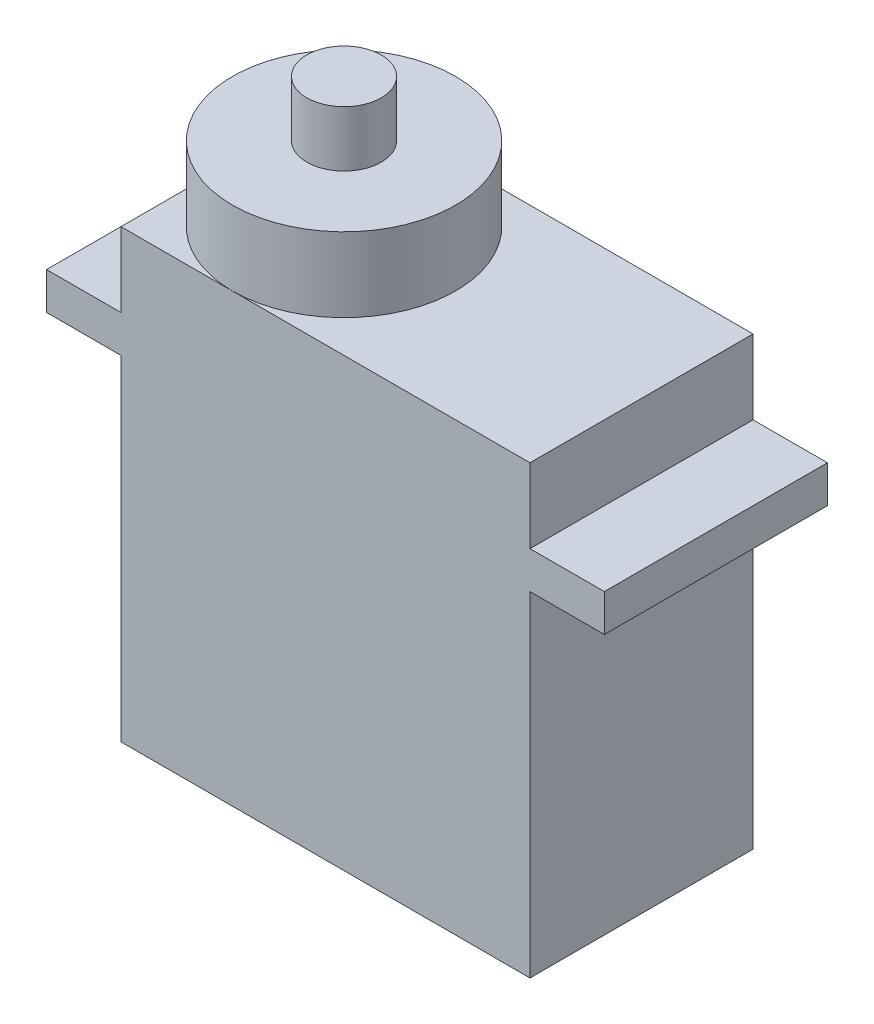
ISO-10303-21;
HEADER;
FILE_DESCRIPTION(('STEP AP214'),'2;1');
FILE_NAME('part.step','',(''),(''),'','','');
FILE_SCHEMA(('AUTOMOTIVE_DESIGN { 1 0 10303 214 1 1 1 1 }'));
ENDSEC;
DATA;
#1=APPLICATION_CONTEXT('core data for automotive mechanical design processes');
#2=APPLICATION_PROTOCOL_DEFINITION('international standard','automotive_design',2000,#1);
#3=PRODUCT_CONTEXT('',#1,'mechanical');
#4=PRODUCT('Part','Part','',(#3));
#5=PRODUCT_RELATED_PRODUCT_CATEGORY('part','',(#4));
#6=PRODUCT_DEFINITION_FORMATION('','',#4);
#7=PRODUCT_DEFINITION_CONTEXT('part definition',#1,'design');
#8=PRODUCT_DEFINITION('design','',#6,#7);
#9=PRODUCT_DEFINITION_SHAPE('','',#8);
#10=(LENGTH_UNIT() NAMED_UNIT(*) SI_UNIT(.MILLI.,.METRE.));
#11=(NAMED_UNIT(*) PLANE_ANGLE_UNIT() SI_UNIT($,.RADIAN.));
#12=(NAMED_UNIT(*) SI_UNIT($,.STERADIAN.) SOLID_ANGLE_UNIT());
#13=UNCERTAINTY_MEASURE_WITH_UNIT(LENGTH_MEASURE(1.E-05),#10,'distance_accuracy_value','');
#14=(GEOMETRIC_REPRESENTATION_CONTEXT(3) GLOBAL_UNCERTAINTY_ASSIGNED_CONTEXT((#13)) GLOBAL_UNIT_ASSIGNED_CONTEXT((#10,
#11,#12)) REPRESENTATION_CONTEXT('',''));
#15=CARTESIAN_POINT('',(0.,0.,0.));
#16=DIRECTION('',(0.,0.,1.));
#17=DIRECTION('',(1.,0.,0.));
#18=AXIS2_PLACEMENT_3D('',#15,#16,#17);
#19=CARTESIAN_POINT('',(-11.,12.,12.));
#20=DIRECTION('',(0.,-1.,0.));
#21=DIRECTION('',(0.,0.,-1.));
#22=AXIS2_PLACEMENT_3D('',#19,#20,#21);
#23=PLANE('',#22);
#24=CARTESIAN_POINT('',(-5.,12.,6.));
#25=DIRECTION('',(0.,1.,0.));
#26=DIRECTION('',(0.,0.,1.));
#27=AXIS2_PLACEMENT_3D('',#24,#25,#26);
#28=CIRCLE('',#27,6.);
#29=CARTESIAN_POINT('',(-5.,12.,12.));
#30=VERTEX_POINT('',#29);
#31=CARTESIAN_POINT('',(-5.,12.,0.));
#32=VERTEX_POINT('',#31);
#33=EDGE_CURVE('E155',#30,#32,#28,.T.);
#34=ORIENTED_EDGE('',*,*,#33,.F.);
#35=DIRECTION('',(-1.,0.,0.));
#36=VECTOR('',#35,1.);
#37=CARTESIAN_POINT('',(-11.,12.,12.));
#38=LINE('',#37,#36);
#39=CARTESIAN_POINT('',(11.,12.,12.));
#40=VERTEX_POINT('',#39);
#41=EDGE_CURVE('E134',#40,#30,#38,.T.);
#42=ORIENTED_EDGE('',*,*,#41,.F.);
#43=DIRECTION('',(0.,0.,-1.));
#44=VECTOR('',#43,1.);
#45=CARTESIAN_POINT('',(11.,12.,12.));
#46=LINE('',#45,#44);
#47=CARTESIAN_POINT('',(11.,12.,0.));
#48=VERTEX_POINT('',#47);
#49=EDGE_CURVE('E37',#40,#48,#46,.T.);
#50=ORIENTED_EDGE('',*,*,#49,.T.);
#51=DIRECTION('',(-1.,0.,0.));
#52=VECTOR('',#51,1.);
#53=CARTESIAN_POINT('',(-11.,12.,0.));
#54=LINE('',#53,#52);
#55=EDGE_CURVE('E157',#48,#32,#54,.T.);
#56=ORIENTED_EDGE('',*,*,#55,.T.);
#57=EDGE_LOOP('',(#34,#42,#50,#56));
#58=FACE_BOUND('',#57,.T.);
#59=ADVANCED_FACE('F33',(#58),#23,.F.);
#60=CARTESIAN_POINT('',(-11.,12.,6.));
#61=VERTEX_POINT('',#60);
#62=EDGE_CURVE('E42',#32,#61,#28,.T.);
#63=ORIENTED_EDGE('',*,*,#62,.F.);
#64=CARTESIAN_POINT('',(-11.,12.,0.));
#65=VERTEX_POINT('',#64);
#66=EDGE_CURVE('E224',#32,#65,#54,.T.);
#67=ORIENTED_EDGE('',*,*,#66,.T.);
#68=DIRECTION('',(0.,0.,-1.));
#69=VECTOR('',#68,1.);
#70=CARTESIAN_POINT('',(-11.,12.,12.));
#71=LINE('',#70,#69);
#72=EDGE_CURVE('E236',#61,#65,#71,.T.);
#73=ORIENTED_EDGE('',*,*,#72,.F.);
#74=EDGE_LOOP('',(#63,#67,#73));
#75=FACE_BOUND('',#74,.T.);
#76=ADVANCED_FACE('F240',(#75),#23,.F.);
#77=CARTESIAN_POINT('',(11.,-12.,12.));
#78=DIRECTION('',(-1.,0.,0.));
#79=DIRECTION('',(0.,0.,1.));
#80=AXIS2_PLACEMENT_3D('',#77,#78,#79);
#81=PLANE('',#80);
#82=DIRECTION('',(0.,1.,0.));
#83=VECTOR('',#82,1.);
#84=CARTESIAN_POINT('',(11.,-12.,12.));
#85=LINE('',#84,#83);
#86=CARTESIAN_POINT('',(11.,8.,12.));
#87=VERTEX_POINT('',#86);
#88=EDGE_CURVE('E141',#87,#40,#85,.T.);
#89=ORIENTED_EDGE('',*,*,#88,.F.);
#90=DIRECTION('',(0.,0.,-1.));
#91=VECTOR('',#90,1.);
#92=CARTESIAN_POINT('',(11.,8.,12.));
#93=LINE('',#92,#91);
#94=CARTESIAN_POINT('',(11.,8.,0.));
#95=VERTEX_POINT('',#94);
#96=EDGE_CURVE('E211',#87,#95,#93,.T.);
#97=ORIENTED_EDGE('',*,*,#96,.T.);
#98=DIRECTION('',(0.,1.,0.));
#99=VECTOR('',#98,1.);
#100=CARTESIAN_POINT('',(11.,-12.,0.));
#101=LINE('',#100,#99);
#102=EDGE_CURVE('E214',#95,#48,#101,.T.);
#103=ORIENTED_EDGE('',*,*,#102,.T.);
#104=ORIENTED_EDGE('',*,*,#49,.F.);
#105=EDGE_LOOP('',(#89,#97,#103,#104));
#106=FACE_BOUND('',#105,.T.);
#107=ADVANCED_FACE('F280',(#106),#81,.F.);
#108=CARTESIAN_POINT('',(-11.,-12.,12.));
#109=DIRECTION('',(1.,0.,0.));
#110=DIRECTION('',(0.,0.,-1.));
#111=AXIS2_PLACEMENT_3D('',#108,#109,#110);
#112=PLANE('',#111);
#113=DIRECTION('',(0.,-1.,0.));
#114=VECTOR('',#113,1.);
#115=CARTESIAN_POINT('',(-11.,-12.,0.));
#116=LINE('',#115,#114);
#117=CARTESIAN_POINT('',(-11.,8.,0.));
#118=VERTEX_POINT('',#117);
#119=EDGE_CURVE('E227',#65,#118,#116,.T.);
#120=ORIENTED_EDGE('',*,*,#119,.T.);
#121=DIRECTION('',(0.,0.,1.));
#122=VECTOR('',#121,1.);
#123=CARTESIAN_POINT('',(-11.,8.,12.));
#124=LINE('',#123,#122);
#125=CARTESIAN_POINT('',(-11.,8.,12.));
#126=VERTEX_POINT('',#125);
#127=EDGE_CURVE('E208',#118,#126,#124,.T.);
#128=ORIENTED_EDGE('',*,*,#127,.T.);
#129=DIRECTION('',(0.,-1.,0.));
#130=VECTOR('',#129,1.);
#131=CARTESIAN_POINT('',(-11.,-12.,12.));
#132=LINE('',#131,#130);
#133=CARTESIAN_POINT('',(-11.,12.,12.));
#134=VERTEX_POINT('',#133);
#135=EDGE_CURVE('E216',#134,#126,#132,.T.);
#136=ORIENTED_EDGE('',*,*,#135,.F.);
#137=EDGE_CURVE('E150',#134,#61,#71,.T.);
#138=ORIENTED_EDGE('',*,*,#137,.T.);
#139=ORIENTED_EDGE('',*,*,#72,.T.);
#140=EDGE_LOOP('',(#120,#128,#136,#138,#139));
#141=FACE_BOUND('',#140,.T.);
#142=ADVANCED_FACE('F238',(#141),#112,.F.);
#143=CARTESIAN_POINT('',(11.,-12.,0.));
#144=VERTEX_POINT('',#143);
#145=CARTESIAN_POINT('',(11.,6.,0.));
#146=VERTEX_POINT('',#145);
#147=EDGE_CURVE('E221',#144,#146,#101,.T.);
#148=ORIENTED_EDGE('',*,*,#147,.T.);
#149=DIRECTION('',(0.,0.,1.));
#150=VECTOR('',#149,1.);
#151=CARTESIAN_POINT('',(11.,6.,12.));
#152=LINE('',#151,#150);
#153=CARTESIAN_POINT('',(11.,6.,12.));
#154=VERTEX_POINT('',#153);
#155=EDGE_CURVE('E205',#146,#154,#152,.T.);
#156=ORIENTED_EDGE('',*,*,#155,.T.);
#157=CARTESIAN_POINT('',(11.,-12.,12.));
#158=VERTEX_POINT('',#157);
#159=EDGE_CURVE('E152',#158,#154,#85,.T.);
#160=ORIENTED_EDGE('',*,*,#159,.F.);
#161=DIRECTION('',(0.,0.,-1.));
#162=VECTOR('',#161,1.);
#163=CARTESIAN_POINT('',(11.,-12.,12.));
#164=LINE('',#163,#162);
#165=EDGE_CURVE('E220',#158,#144,#164,.T.);
#166=ORIENTED_EDGE('',*,*,#165,.T.);
#167=EDGE_LOOP('',(#148,#156,#160,#166));
#168=FACE_BOUND('',#167,.T.);
#169=ADVANCED_FACE('F35',(#168),#81,.F.);
#170=EDGE_CURVE('E50',#61,#30,#28,.T.);
#171=ORIENTED_EDGE('',*,*,#170,.F.);
#172=ORIENTED_EDGE('',*,*,#137,.F.);
#173=EDGE_CURVE('E138',#30,#134,#38,.T.);
#174=ORIENTED_EDGE('',*,*,#173,.F.);
#175=EDGE_LOOP('',(#171,#172,#174));
#176=FACE_BOUND('',#175,.T.);
#177=ADVANCED_FACE('F148',(#176),#23,.F.);
#178=CARTESIAN_POINT('',(-11.,6.,12.));
#179=VERTEX_POINT('',#178);
#180=CARTESIAN_POINT('',(-11.,-12.,12.));
#181=VERTEX_POINT('',#180);
#182=EDGE_CURVE('E146',#179,#181,#132,.T.);
#183=ORIENTED_EDGE('',*,*,#182,.F.);
#184=DIRECTION('',(0.,0.,-1.));
#185=VECTOR('',#184,1.);
#186=CARTESIAN_POINT('',(-11.,6.,12.));
#187=LINE('',#186,#185);
#188=CARTESIAN_POINT('',(-11.,6.,0.));
#189=VERTEX_POINT('',#188);
#190=EDGE_CURVE('E192',#179,#189,#187,.T.);
#191=ORIENTED_EDGE('',*,*,#190,.T.);
#192=CARTESIAN_POINT('',(-11.,-12.,0.));
#193=VERTEX_POINT('',#192);
#194=EDGE_CURVE('E226',#189,#193,#116,.T.);
#195=ORIENTED_EDGE('',*,*,#194,.T.);
#196=DIRECTION('',(0.,0.,-1.));
#197=VECTOR('',#196,1.);
#198=CARTESIAN_POINT('',(-11.,-12.,12.));
#199=LINE('',#198,#197);
#200=EDGE_CURVE('E234',#181,#193,#199,.T.);
#201=ORIENTED_EDGE('',*,*,#200,.F.);
#202=EDGE_LOOP('',(#183,#191,#195,#201));
#203=FACE_BOUND('',#202,.T.);
#204=ADVANCED_FACE('F259',(#203),#112,.F.);
#205=CARTESIAN_POINT('',(-11.,-12.,12.));
#206=DIRECTION('',(0.,1.,0.));
#207=DIRECTION('',(0.,0.,1.));
#208=AXIS2_PLACEMENT_3D('',#205,#206,#207);
#209=PLANE('',#208);
#210=DIRECTION('',(1.,0.,0.));
#211=VECTOR('',#210,1.);
#212=CARTESIAN_POINT('',(-11.,-12.,0.));
#213=LINE('',#212,#211);
#214=EDGE_CURVE('E230',#193,#144,#213,.T.);
#215=ORIENTED_EDGE('',*,*,#214,.T.);
#216=ORIENTED_EDGE('',*,*,#165,.F.);
#217=DIRECTION('',(1.,0.,0.));
#218=VECTOR('',#217,1.);
#219=CARTESIAN_POINT('',(-11.,-12.,12.));
#220=LINE('',#219,#218);
#221=EDGE_CURVE('E218',#181,#158,#220,.T.);
#222=ORIENTED_EDGE('',*,*,#221,.F.);
#223=ORIENTED_EDGE('',*,*,#200,.T.);
#224=EDGE_LOOP('',(#215,#216,#222,#223));
#225=FACE_BOUND('',#224,.T.);
#226=ADVANCED_FACE('F264',(#225),#209,.F.);
#227=CARTESIAN_POINT('',(0.,0.,12.));
#228=DIRECTION('',(0.,0.,-1.));
#229=DIRECTION('',(-1.,0.,0.));
#230=AXIS2_PLACEMENT_3D('',#227,#228,#229);
#231=PLANE('',#230);
#232=ORIENTED_EDGE('',*,*,#159,.T.);
#233=DIRECTION('',(-1.,0.,0.));
#234=VECTOR('',#233,1.);
#235=CARTESIAN_POINT('',(15.,6.,12.));
#236=LINE('',#235,#234);
#237=CARTESIAN_POINT('',(15.,6.,12.));
#238=VERTEX_POINT('',#237);
#239=EDGE_CURVE('E197',#238,#154,#236,.T.);
#240=ORIENTED_EDGE('',*,*,#239,.F.);
#241=DIRECTION('',(0.,1.,0.));
#242=VECTOR('',#241,1.);
#243=CARTESIAN_POINT('',(15.,8.,12.));
#244=LINE('',#243,#242);
#245=CARTESIAN_POINT('',(15.,8.,12.));
#246=VERTEX_POINT('',#245);
#247=EDGE_CURVE('E172',#238,#246,#244,.T.);
#248=ORIENTED_EDGE('',*,*,#247,.T.);
#249=DIRECTION('',(-1.,0.,0.));
#250=VECTOR('',#249,1.);
#251=CARTESIAN_POINT('',(15.,8.,12.));
#252=LINE('',#251,#250);
#253=EDGE_CURVE('E194',#246,#87,#252,.T.);
#254=ORIENTED_EDGE('',*,*,#253,.T.);
#255=ORIENTED_EDGE('',*,*,#88,.T.);
#256=ORIENTED_EDGE('',*,*,#41,.T.);
#257=ORIENTED_EDGE('',*,*,#173,.T.);
#258=ORIENTED_EDGE('',*,*,#135,.T.);
#259=CARTESIAN_POINT('',(-15.,8.,12.));
#260=VERTEX_POINT('',#259);
#261=EDGE_CURVE('E196',#126,#260,#252,.T.);
#262=ORIENTED_EDGE('',*,*,#261,.T.);
#263=DIRECTION('',(0.,1.,0.));
#264=VECTOR('',#263,1.);
#265=CARTESIAN_POINT('',(-15.,8.,12.));
#266=LINE('',#265,#264);
#267=CARTESIAN_POINT('',(-15.,6.,12.));
#268=VERTEX_POINT('',#267);
#269=EDGE_CURVE('E185',#268,#260,#266,.T.);
#270=ORIENTED_EDGE('',*,*,#269,.F.);
#271=EDGE_CURVE('E199',#179,#268,#236,.T.);
#272=ORIENTED_EDGE('',*,*,#271,.F.);
#273=ORIENTED_EDGE('',*,*,#182,.T.);
#274=ORIENTED_EDGE('',*,*,#221,.T.);
#275=EDGE_LOOP('',(#232,#240,#248,#254,#255,#256,#257,#258,#262,#270,#272,#273,#274));
#276=FACE_BOUND('',#275,.T.);
#277=ADVANCED_FACE('F136',(#276),#231,.F.);
#278=CARTESIAN_POINT('',(0.,0.,0.));
#279=DIRECTION('',(0.,0.,-1.));
#280=DIRECTION('',(-1.,0.,0.));
#281=AXIS2_PLACEMENT_3D('',#278,#279,#280);
#282=PLANE('',#281);
#283=ORIENTED_EDGE('',*,*,#194,.F.);
#284=DIRECTION('',(-1.,0.,0.));
#285=VECTOR('',#284,1.);
#286=CARTESIAN_POINT('',(15.,6.,0.));
#287=LINE('',#286,#285);
#288=CARTESIAN_POINT('',(-15.,6.,0.));
#289=VERTEX_POINT('',#288);
#290=EDGE_CURVE('E178',#189,#289,#287,.T.);
#291=ORIENTED_EDGE('',*,*,#290,.T.);
#292=DIRECTION('',(0.,-1.,0.));
#293=VECTOR('',#292,1.);
#294=CARTESIAN_POINT('',(-15.,8.,0.));
#295=LINE('',#294,#293);
#296=CARTESIAN_POINT('',(-15.,8.,0.));
#297=VERTEX_POINT('',#296);
#298=EDGE_CURVE('E179',#297,#289,#295,.T.);
#299=ORIENTED_EDGE('',*,*,#298,.F.);
#300=DIRECTION('',(-1.,0.,0.));
#301=VECTOR('',#300,1.);
#302=CARTESIAN_POINT('',(15.,8.,0.));
#303=LINE('',#302,#301);
#304=EDGE_CURVE('E193',#118,#297,#303,.T.);
#305=ORIENTED_EDGE('',*,*,#304,.F.);
#306=ORIENTED_EDGE('',*,*,#119,.F.);
#307=ORIENTED_EDGE('',*,*,#66,.F.);
#308=ORIENTED_EDGE('',*,*,#55,.F.);
#309=ORIENTED_EDGE('',*,*,#102,.F.);
#310=CARTESIAN_POINT('',(15.,8.,0.));
#311=VERTEX_POINT('',#310);
#312=EDGE_CURVE('E190',#311,#95,#303,.T.);
#313=ORIENTED_EDGE('',*,*,#312,.F.);
#314=DIRECTION('',(0.,-1.,0.));
#315=VECTOR('',#314,1.);
#316=CARTESIAN_POINT('',(15.,8.,0.));
#317=LINE('',#316,#315);
#318=CARTESIAN_POINT('',(15.,6.,0.));
#319=VERTEX_POINT('',#318);
#320=EDGE_CURVE('E165',#311,#319,#317,.T.);
#321=ORIENTED_EDGE('',*,*,#320,.T.);
#322=EDGE_CURVE('E200',#319,#146,#287,.T.);
#323=ORIENTED_EDGE('',*,*,#322,.T.);
#324=ORIENTED_EDGE('',*,*,#147,.F.);
#325=ORIENTED_EDGE('',*,*,#214,.F.);
#326=EDGE_LOOP('',(#283,#291,#299,#305,#306,#307,#308,#309,#313,#321,#323,#324,#325));
#327=FACE_BOUND('',#326,.T.);
#328=ADVANCED_FACE('F244',(#327),#282,.T.);
#329=CARTESIAN_POINT('',(-15.,0.,0.));
#330=DIRECTION('',(-1.,0.,0.));
#331=DIRECTION('',(0.,0.,1.));
#332=AXIS2_PLACEMENT_3D('',#329,#330,#331);
#333=PLANE('',#332);
#334=ORIENTED_EDGE('',*,*,#298,.T.);
#335=DIRECTION('',(0.,0.,1.));
#336=VECTOR('',#335,1.);
#337=CARTESIAN_POINT('',(-15.,6.,0.));
#338=LINE('',#337,#336);
#339=EDGE_CURVE('E182',#289,#268,#338,.T.);
#340=ORIENTED_EDGE('',*,*,#339,.T.);
#341=ORIENTED_EDGE('',*,*,#269,.T.);
#342=DIRECTION('',(0.,0.,-1.));
#343=VECTOR('',#342,1.);
#344=CARTESIAN_POINT('',(-15.,8.,0.));
#345=LINE('',#344,#343);
#346=EDGE_CURVE('E169',#260,#297,#345,.T.);
#347=ORIENTED_EDGE('',*,*,#346,.T.);
#348=EDGE_LOOP('',(#334,#340,#341,#347));
#349=FACE_BOUND('',#348,.T.);
#350=ADVANCED_FACE('F252',(#349),#333,.T.);
#351=CARTESIAN_POINT('',(15.,6.,0.));
#352=DIRECTION('',(0.,-1.,0.));
#353=DIRECTION('',(0.,0.,-1.));
#354=AXIS2_PLACEMENT_3D('',#351,#352,#353);
#355=PLANE('',#354);
#356=ORIENTED_EDGE('',*,*,#190,.F.);
#357=ORIENTED_EDGE('',*,*,#271,.T.);
#358=ORIENTED_EDGE('',*,*,#339,.F.);
#359=ORIENTED_EDGE('',*,*,#290,.F.);
#360=EDGE_LOOP('',(#356,#357,#358,#359));
#361=FACE_BOUND('',#360,.T.);
#362=ADVANCED_FACE('F255',(#361),#355,.T.);
#363=CARTESIAN_POINT('',(15.,8.,0.));
#364=DIRECTION('',(0.,1.,0.));
#365=DIRECTION('',(0.,0.,1.));
#366=AXIS2_PLACEMENT_3D('',#363,#364,#365);
#367=PLANE('',#366);
#368=ORIENTED_EDGE('',*,*,#127,.F.);
#369=ORIENTED_EDGE('',*,*,#304,.T.);
#370=ORIENTED_EDGE('',*,*,#346,.F.);
#371=ORIENTED_EDGE('',*,*,#261,.F.);
#372=EDGE_LOOP('',(#368,#369,#370,#371));
#373=FACE_BOUND('',#372,.T.);
#374=ADVANCED_FACE('F248',(#373),#367,.T.);
#375=ORIENTED_EDGE('',*,*,#96,.F.);
#376=ORIENTED_EDGE('',*,*,#253,.F.);
#377=DIRECTION('',(0.,0.,-1.));
#378=VECTOR('',#377,1.);
#379=CARTESIAN_POINT('',(15.,8.,0.));
#380=LINE('',#379,#378);
#381=EDGE_CURVE('E175',#246,#311,#380,.T.);
#382=ORIENTED_EDGE('',*,*,#381,.T.);
#383=ORIENTED_EDGE('',*,*,#312,.T.);
#384=EDGE_LOOP('',(#375,#376,#382,#383));
#385=FACE_BOUND('',#384,.T.);
#386=ADVANCED_FACE('F278',(#385),#367,.T.);
#387=ORIENTED_EDGE('',*,*,#155,.F.);
#388=ORIENTED_EDGE('',*,*,#322,.F.);
#389=DIRECTION('',(0.,0.,1.));
#390=VECTOR('',#389,1.);
#391=CARTESIAN_POINT('',(15.,6.,0.));
#392=LINE('',#391,#390);
#393=EDGE_CURVE('E168',#319,#238,#392,.T.);
#394=ORIENTED_EDGE('',*,*,#393,.T.);
#395=ORIENTED_EDGE('',*,*,#239,.T.);
#396=EDGE_LOOP('',(#387,#388,#394,#395));
#397=FACE_BOUND('',#396,.T.);
#398=ADVANCED_FACE('F270',(#397),#355,.T.);
#399=CARTESIAN_POINT('',(15.,0.,0.));
#400=DIRECTION('',(-1.,0.,0.));
#401=DIRECTION('',(0.,0.,1.));
#402=AXIS2_PLACEMENT_3D('',#399,#400,#401);
#403=PLANE('',#402);
#404=ORIENTED_EDGE('',*,*,#320,.F.);
#405=ORIENTED_EDGE('',*,*,#381,.F.);
#406=ORIENTED_EDGE('',*,*,#247,.F.);
#407=ORIENTED_EDGE('',*,*,#393,.F.);
#408=EDGE_LOOP('',(#404,#405,#406,#407));
#409=FACE_BOUND('',#408,.T.);
#410=ADVANCED_FACE('F276',(#409),#403,.F.);
#411=CARTESIAN_POINT('',(-5.,16.,6.));
#412=DIRECTION('',(0.,-1.,0.));
#413=DIRECTION('',(0.,0.,-1.));
#414=AXIS2_PLACEMENT_3D('',#411,#412,#413);
#415=CYLINDRICAL_SURFACE('',#414,6.);
#416=CARTESIAN_POINT('',(-5.,16.,6.));
#417=DIRECTION('',(0.,1.,0.));
#418=DIRECTION('',(0.,0.,1.));
#419=AXIS2_PLACEMENT_3D('',#416,#417,#418);
#420=CIRCLE('',#419,6.);
#421=CARTESIAN_POINT('',(-5.,16.,12.));
#422=VERTEX_POINT('',#421);
#423=EDGE_CURVE('E159',#422,#422,#420,.T.);
#424=ORIENTED_EDGE('',*,*,#423,.F.);
#425=EDGE_LOOP('',(#424));
#426=FACE_BOUND('',#425,.T.);
#427=ORIENTED_EDGE('',*,*,#33,.T.);
#428=ORIENTED_EDGE('',*,*,#62,.T.);
#429=ORIENTED_EDGE('',*,*,#170,.T.);
#430=EDGE_LOOP('',(#427,#428,#429));
#431=FACE_BOUND('',#430,.T.);
#432=ADVANCED_FACE('F162',(#426,#431),#415,.T.);
#433=CARTESIAN_POINT('',(-5.,16.,6.));
#434=DIRECTION('',(0.,1.,0.));
#435=DIRECTION('',(0.,0.,1.));
#436=AXIS2_PLACEMENT_3D('',#433,#434,#435);
#437=PLANE('',#436);
#438=CARTESIAN_POINT('',(-5.,16.,6.));
#439=DIRECTION('',(0.,1.,0.));
#440=DIRECTION('',(0.,0.,1.));
#441=AXIS2_PLACEMENT_3D('',#438,#439,#440);
#442=CIRCLE('',#441,2.);
#443=CARTESIAN_POINT('',(-5.,16.,8.));
#444=VERTEX_POINT('',#443);
#445=EDGE_CURVE('E11',#444,#444,#442,.T.);
#446=ORIENTED_EDGE('',*,*,#445,.F.);
#447=EDGE_LOOP('',(#446));
#448=FACE_BOUND('',#447,.T.);
#449=ORIENTED_EDGE('',*,*,#423,.T.);
#450=EDGE_LOOP('',(#449));
#451=FACE_BOUND('',#450,.T.);
#452=ADVANCED_FACE('F314',(#448,#451),#437,.T.);
#453=CARTESIAN_POINT('',(-5.,19.,6.));
#454=DIRECTION('',(0.,-1.,0.));
#455=DIRECTION('',(0.,0.,-1.));
#456=AXIS2_PLACEMENT_3D('',#453,#454,#455);
#457=CYLINDRICAL_SURFACE('',#456,2.);
#458=CARTESIAN_POINT('',(-5.,19.,6.));
#459=DIRECTION('',(0.,1.,0.));
#460=DIRECTION('',(0.,0.,1.));
#461=AXIS2_PLACEMENT_3D('',#458,#459,#460);
#462=CIRCLE('',#461,2.);
#463=CARTESIAN_POINT('',(-5.,19.,8.));
#464=VERTEX_POINT('',#463);
#465=EDGE_CURVE('E160',#464,#464,#462,.T.);
#466=ORIENTED_EDGE('',*,*,#465,.F.);
#467=EDGE_LOOP('',(#466));
#468=FACE_BOUND('',#467,.T.);
#469=ORIENTED_EDGE('',*,*,#445,.T.);
#470=EDGE_LOOP('',(#469));
#471=FACE_BOUND('',#470,.T.);
#472=ADVANCED_FACE('F318',(#468,#471),#457,.T.);
#473=CARTESIAN_POINT('',(-5.,19.,6.));
#474=DIRECTION('',(0.,1.,0.));
#475=DIRECTION('',(0.,0.,1.));
#476=AXIS2_PLACEMENT_3D('',#473,#474,#475);
#477=PLANE('',#476);
#478=ORIENTED_EDGE('',*,*,#465,.T.);
#479=EDGE_LOOP('',(#478));
#480=FACE_BOUND('',#479,.T.);
#481=ADVANCED_FACE('F322',(#480),#477,.T.);
#482=CLOSED_SHELL('',(#59,#76,#107,#142,#169,#177,#204,#226,#277,#328,#350,#362,#374,#386,#398,
#410,#432,#452,#472,#481));
#483=MANIFOLD_SOLID_BREP('B2',#482);
#484=ADVANCED_BREP_SHAPE_REPRESENTATION('',(#18,#483),#14);
#485=SHAPE_DEFINITION_REPRESENTATION(#9,#484);
ENDSEC;
END-ISO-10303-21;
